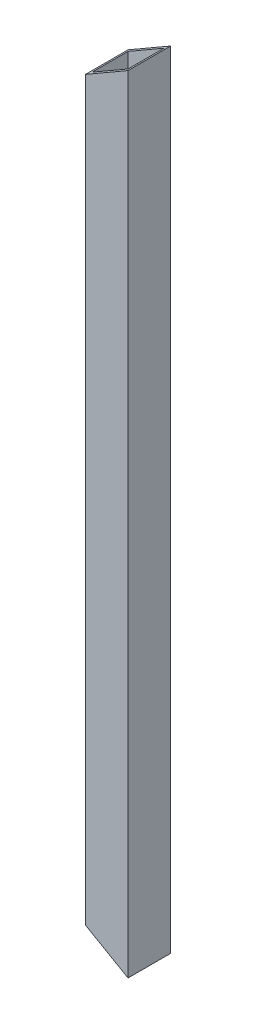
ISO-10303-21;
HEADER;
FILE_DESCRIPTION(('STEP AP214'),'2;1');
FILE_NAME('part.step','',(''),(''),'','','');
FILE_SCHEMA(('AUTOMOTIVE_DESIGN { 1 0 10303 214 1 1 1 1 }'));
ENDSEC;
DATA;
#1=APPLICATION_CONTEXT('core data for automotive mechanical design processes');
#2=APPLICATION_PROTOCOL_DEFINITION('international standard','automotive_design',2000,#1);
#3=PRODUCT_CONTEXT('',#1,'mechanical');
#4=PRODUCT('Part','Part','',(#3));
#5=PRODUCT_RELATED_PRODUCT_CATEGORY('part','',(#4));
#6=PRODUCT_DEFINITION_FORMATION('','',#4);
#7=PRODUCT_DEFINITION_CONTEXT('part definition',#1,'design');
#8=PRODUCT_DEFINITION('design','',#6,#7);
#9=PRODUCT_DEFINITION_SHAPE('','',#8);
#10=(LENGTH_UNIT() NAMED_UNIT(*) SI_UNIT(.MILLI.,.METRE.));
#11=(NAMED_UNIT(*) PLANE_ANGLE_UNIT() SI_UNIT($,.RADIAN.));
#12=(NAMED_UNIT(*) SI_UNIT($,.STERADIAN.) SOLID_ANGLE_UNIT());
#13=UNCERTAINTY_MEASURE_WITH_UNIT(LENGTH_MEASURE(1.E-05),#10,'distance_accuracy_value','');
#14=(GEOMETRIC_REPRESENTATION_CONTEXT(3) GLOBAL_UNCERTAINTY_ASSIGNED_CONTEXT((#13)) GLOBAL_UNIT_ASSIGNED_CONTEXT((#10,
#11,#12)) REPRESENTATION_CONTEXT('',''));
#15=CARTESIAN_POINT('',(0.,0.,0.));
#16=DIRECTION('',(0.,0.,1.));
#17=DIRECTION('',(1.,0.,0.));
#18=AXIS2_PLACEMENT_3D('',#15,#16,#17);
#19=CARTESIAN_POINT('',(-6.5,240.,6.5));
#20=DIRECTION('',(1.,0.,0.));
#21=DIRECTION('',(0.,0.,-1.));
#22=AXIS2_PLACEMENT_3D('',#19,#20,#21);
#23=PLANE('',#22);
#24=DIRECTION('',(0.,0.,1.));
#25=VECTOR('',#24,1.);
#26=CARTESIAN_POINT('',(-6.5,7.50555349946502,-233.5));
#27=LINE('',#26,#25);
#28=CARTESIAN_POINT('',(-6.5,7.50555349946502,-6.5));
#29=VERTEX_POINT('',#28);
#30=CARTESIAN_POINT('',(-6.5,7.50555349946502,6.5));
#31=VERTEX_POINT('',#30);
#32=EDGE_CURVE('E55',#29,#31,#27,.T.);
#33=ORIENTED_EDGE('',*,*,#32,.T.);
#34=DIRECTION('',(0.,-1.,0.));
#35=VECTOR('',#34,1.);
#36=CARTESIAN_POINT('',(-6.5,240.,6.5));
#37=LINE('',#36,#35);
#38=CARTESIAN_POINT('',(-6.5,232.494446500535,6.50000000000001));
#39=VERTEX_POINT('',#38);
#40=EDGE_CURVE('E116',#39,#31,#37,.T.);
#41=ORIENTED_EDGE('',*,*,#40,.F.);
#42=DIRECTION('',(0.,0.,-1.));
#43=VECTOR('',#42,1.);
#44=CARTESIAN_POINT('',(-6.5,232.494446500535,307.37892083029));
#45=LINE('',#44,#43);
#46=CARTESIAN_POINT('',(-6.5,232.494446500535,-6.50000000000001));
#47=VERTEX_POINT('',#46);
#48=EDGE_CURVE('E177',#39,#47,#45,.T.);
#49=ORIENTED_EDGE('',*,*,#48,.T.);
#50=DIRECTION('',(0.,-1.,0.));
#51=VECTOR('',#50,1.);
#52=CARTESIAN_POINT('',(-6.5,240.,-6.5));
#53=LINE('',#52,#51);
#54=EDGE_CURVE('E118',#47,#29,#53,.T.);
#55=ORIENTED_EDGE('',*,*,#54,.T.);
#56=EDGE_LOOP('',(#33,#41,#49,#55));
#57=FACE_BOUND('',#56,.T.);
#58=ADVANCED_FACE('F40',(#57),#23,.F.);
#59=CARTESIAN_POINT('',(-6.5,240.,6.5));
#60=DIRECTION('',(0.,0.,-1.));
#61=DIRECTION('',(-1.,0.,0.));
#62=AXIS2_PLACEMENT_3D('',#59,#60,#61);
#63=PLANE('',#62);
#64=DIRECTION('',(0.866025403784442,-0.499999999999994,0.));
#65=VECTOR('',#64,1.);
#66=CARTESIAN_POINT('',(6.5,0.,6.5));
#67=LINE('',#66,#65);
#68=CARTESIAN_POINT('',(6.5,0.,6.5));
#69=VERTEX_POINT('',#68);
#70=EDGE_CURVE('E102',#31,#69,#67,.T.);
#71=ORIENTED_EDGE('',*,*,#70,.T.);
#72=DIRECTION('',(0.,-1.,0.));
#73=VECTOR('',#72,1.);
#74=CARTESIAN_POINT('',(6.5,240.,6.5));
#75=LINE('',#74,#73);
#76=CARTESIAN_POINT('',(6.5,240.,6.50000000000001));
#77=VERTEX_POINT('',#76);
#78=EDGE_CURVE('E125',#77,#69,#75,.T.);
#79=ORIENTED_EDGE('',*,*,#78,.F.);
#80=DIRECTION('',(-0.866025403784442,-0.499999999999995,0.));
#81=VECTOR('',#80,1.);
#82=CARTESIAN_POINT('',(-3.25000000000007,234.370834875401,6.5));
#83=LINE('',#82,#81);
#84=EDGE_CURVE('E123',#77,#39,#83,.T.);
#85=ORIENTED_EDGE('',*,*,#84,.T.);
#86=ORIENTED_EDGE('',*,*,#40,.T.);
#87=EDGE_LOOP('',(#71,#79,#85,#86));
#88=FACE_BOUND('',#87,.T.);
#89=ADVANCED_FACE('F122',(#88),#63,.F.);
#90=CARTESIAN_POINT('',(-6.5,240.,-6.5));
#91=DIRECTION('',(0.,0.,1.));
#92=DIRECTION('',(1.,0.,0.));
#93=AXIS2_PLACEMENT_3D('',#90,#91,#92);
#94=PLANE('',#93);
#95=DIRECTION('',(0.866025403784442,-0.499999999999994,0.));
#96=VECTOR('',#95,1.);
#97=CARTESIAN_POINT('',(-107.173048454132,65.6291651245974,-6.49999999999999));
#98=LINE('',#97,#96);
#99=CARTESIAN_POINT('',(6.5,0.,-6.50000000000001));
#100=VERTEX_POINT('',#99);
#101=EDGE_CURVE('E180',#29,#100,#98,.T.);
#102=ORIENTED_EDGE('',*,*,#101,.F.);
#103=ORIENTED_EDGE('',*,*,#54,.F.);
#104=DIRECTION('',(0.866025403784442,0.499999999999994,0.));
#105=VECTOR('',#104,1.);
#106=CARTESIAN_POINT('',(-3.25000000000007,234.370834875401,-6.5));
#107=LINE('',#106,#105);
#108=CARTESIAN_POINT('',(6.5,240.,-6.5));
#109=VERTEX_POINT('',#108);
#110=EDGE_CURVE('E161',#47,#109,#107,.T.);
#111=ORIENTED_EDGE('',*,*,#110,.T.);
#112=DIRECTION('',(0.,-1.,0.));
#113=VECTOR('',#112,1.);
#114=CARTESIAN_POINT('',(6.5,240.,-6.5));
#115=LINE('',#114,#113);
#116=EDGE_CURVE('E130',#109,#100,#115,.T.);
#117=ORIENTED_EDGE('',*,*,#116,.T.);
#118=EDGE_LOOP('',(#102,#103,#111,#117));
#119=FACE_BOUND('',#118,.T.);
#120=ADVANCED_FACE('F218',(#119),#94,.F.);
#121=CARTESIAN_POINT('',(5.5,240.,5.5));
#122=DIRECTION('',(-1.,0.,0.));
#123=DIRECTION('',(0.,0.,1.));
#124=AXIS2_PLACEMENT_3D('',#121,#122,#123);
#125=PLANE('',#124);
#126=DIRECTION('',(0.,-1.,0.));
#127=VECTOR('',#126,1.);
#128=CARTESIAN_POINT('',(5.5,240.,-5.5));
#129=LINE('',#128,#127);
#130=CARTESIAN_POINT('',(5.5,239.42264973081,-5.5));
#131=VERTEX_POINT('',#130);
#132=CARTESIAN_POINT('',(5.50000000000001,0.577350269189578,-5.5));
#133=VERTEX_POINT('',#132);
#134=EDGE_CURVE('E141',#131,#133,#129,.T.);
#135=ORIENTED_EDGE('',*,*,#134,.T.);
#136=DIRECTION('',(0.,0.,1.));
#137=VECTOR('',#136,1.);
#138=CARTESIAN_POINT('',(5.5,0.577350269189619,5.5));
#139=LINE('',#138,#137);
#140=CARTESIAN_POINT('',(5.50000000000001,0.577350269189578,5.5));
#141=VERTEX_POINT('',#140);
#142=EDGE_CURVE('E183',#133,#141,#139,.T.);
#143=ORIENTED_EDGE('',*,*,#142,.T.);
#144=DIRECTION('',(0.,-1.,0.));
#145=VECTOR('',#144,1.);
#146=CARTESIAN_POINT('',(5.5,240.,5.5));
#147=LINE('',#146,#145);
#148=CARTESIAN_POINT('',(5.5,239.42264973081,5.5));
#149=VERTEX_POINT('',#148);
#150=EDGE_CURVE('E155',#149,#141,#147,.T.);
#151=ORIENTED_EDGE('',*,*,#150,.F.);
#152=DIRECTION('',(0.,0.,1.));
#153=VECTOR('',#152,1.);
#154=CARTESIAN_POINT('',(5.5,239.42264973081,5.5));
#155=LINE('',#154,#153);
#156=EDGE_CURVE('E165',#131,#149,#155,.T.);
#157=ORIENTED_EDGE('',*,*,#156,.F.);
#158=EDGE_LOOP('',(#135,#143,#151,#157));
#159=FACE_BOUND('',#158,.T.);
#160=ADVANCED_FACE('F206',(#159),#125,.T.);
#161=CARTESIAN_POINT('',(-5.5,240.,-5.5));
#162=DIRECTION('',(0.,0.,1.));
#163=DIRECTION('',(1.,0.,0.));
#164=AXIS2_PLACEMENT_3D('',#161,#162,#163);
#165=PLANE('',#164);
#166=DIRECTION('',(0.,-1.,0.));
#167=VECTOR('',#166,1.);
#168=CARTESIAN_POINT('',(-5.5,240.,-5.5));
#169=LINE('',#168,#167);
#170=CARTESIAN_POINT('',(-5.5,233.071796769725,-5.5));
#171=VERTEX_POINT('',#170);
#172=CARTESIAN_POINT('',(-5.5,6.9282032302754,-5.5));
#173=VERTEX_POINT('',#172);
#174=EDGE_CURVE('E147',#171,#173,#169,.T.);
#175=ORIENTED_EDGE('',*,*,#174,.T.);
#176=DIRECTION('',(0.866025403784442,-0.499999999999994,0.));
#177=VECTOR('',#176,1.);
#178=CARTESIAN_POINT('',(-106.423048454132,65.1961524227052,-5.5));
#179=LINE('',#178,#177);
#180=EDGE_CURVE('E187',#173,#133,#179,.T.);
#181=ORIENTED_EDGE('',*,*,#180,.T.);
#182=ORIENTED_EDGE('',*,*,#134,.F.);
#183=DIRECTION('',(0.866025403784442,0.499999999999995,0.));
#184=VECTOR('',#183,1.);
#185=CARTESIAN_POINT('',(-2.50000000000007,234.803847577293,-5.5));
#186=LINE('',#185,#184);
#187=EDGE_CURVE('E169',#171,#131,#186,.T.);
#188=ORIENTED_EDGE('',*,*,#187,.F.);
#189=EDGE_LOOP('',(#175,#181,#182,#188));
#190=FACE_BOUND('',#189,.T.);
#191=ADVANCED_FACE('F197',(#190),#165,.T.);
#192=CARTESIAN_POINT('',(-5.5,240.,5.5));
#193=DIRECTION('',(1.,0.,0.));
#194=DIRECTION('',(0.,0.,-1.));
#195=AXIS2_PLACEMENT_3D('',#192,#193,#194);
#196=PLANE('',#195);
#197=DIRECTION('',(0.,-1.,0.));
#198=VECTOR('',#197,1.);
#199=CARTESIAN_POINT('',(-5.5,240.,5.5));
#200=LINE('',#199,#198);
#201=CARTESIAN_POINT('',(-5.5,233.071796769725,5.5));
#202=VERTEX_POINT('',#201);
#203=CARTESIAN_POINT('',(-5.49999999999999,6.92820323027537,5.5));
#204=VERTEX_POINT('',#203);
#205=EDGE_CURVE('E151',#202,#204,#200,.T.);
#206=ORIENTED_EDGE('',*,*,#205,.T.);
#207=DIRECTION('',(0.,0.,-1.));
#208=VECTOR('',#207,1.);
#209=CARTESIAN_POINT('',(-5.5,6.9282032302754,5.5));
#210=LINE('',#209,#208);
#211=EDGE_CURVE('E63',#204,#173,#210,.T.);
#212=ORIENTED_EDGE('',*,*,#211,.T.);
#213=ORIENTED_EDGE('',*,*,#174,.F.);
#214=DIRECTION('',(0.,0.,-1.));
#215=VECTOR('',#214,1.);
#216=CARTESIAN_POINT('',(-5.5,233.071796769725,5.5));
#217=LINE('',#216,#215);
#218=EDGE_CURVE('E173',#202,#171,#217,.T.);
#219=ORIENTED_EDGE('',*,*,#218,.F.);
#220=EDGE_LOOP('',(#206,#212,#213,#219));
#221=FACE_BOUND('',#220,.T.);
#222=ADVANCED_FACE('F194',(#221),#196,.T.);
#223=CARTESIAN_POINT('',(-5.5,240.,5.5));
#224=DIRECTION('',(0.,0.,-1.));
#225=DIRECTION('',(-1.,0.,0.));
#226=AXIS2_PLACEMENT_3D('',#223,#224,#225);
#227=PLANE('',#226);
#228=ORIENTED_EDGE('',*,*,#150,.T.);
#229=DIRECTION('',(-0.866025403784442,0.499999999999994,0.));
#230=VECTOR('',#229,1.);
#231=CARTESIAN_POINT('',(-106.423048454132,65.1961524227052,5.5));
#232=LINE('',#231,#230);
#233=EDGE_CURVE('E12',#141,#204,#232,.T.);
#234=ORIENTED_EDGE('',*,*,#233,.T.);
#235=ORIENTED_EDGE('',*,*,#205,.F.);
#236=DIRECTION('',(-0.866025403784442,-0.499999999999995,0.));
#237=VECTOR('',#236,1.);
#238=CARTESIAN_POINT('',(-2.50000000000007,234.803847577293,5.5));
#239=LINE('',#238,#237);
#240=EDGE_CURVE('E48',#149,#202,#239,.T.);
#241=ORIENTED_EDGE('',*,*,#240,.F.);
#242=EDGE_LOOP('',(#228,#234,#235,#241));
#243=FACE_BOUND('',#242,.T.);
#244=ADVANCED_FACE('F204',(#243),#227,.T.);
#245=CARTESIAN_POINT('',(6.5,240.,6.5));
#246=DIRECTION('',(-1.,0.,0.));
#247=DIRECTION('',(0.,0.,1.));
#248=AXIS2_PLACEMENT_3D('',#245,#246,#247);
#249=PLANE('',#248);
#250=DIRECTION('',(0.,0.,-1.));
#251=VECTOR('',#250,1.);
#252=CARTESIAN_POINT('',(6.5,0.,6.5));
#253=LINE('',#252,#251);
#254=EDGE_CURVE('E105',#69,#100,#253,.T.);
#255=ORIENTED_EDGE('',*,*,#254,.T.);
#256=ORIENTED_EDGE('',*,*,#116,.F.);
#257=DIRECTION('',(0.,0.,-1.));
#258=VECTOR('',#257,1.);
#259=CARTESIAN_POINT('',(6.5,240.,6.5));
#260=LINE('',#259,#258);
#261=EDGE_CURVE('E138',#77,#109,#260,.T.);
#262=ORIENTED_EDGE('',*,*,#261,.F.);
#263=ORIENTED_EDGE('',*,*,#78,.T.);
#264=EDGE_LOOP('',(#255,#256,#262,#263));
#265=FACE_BOUND('',#264,.T.);
#266=ADVANCED_FACE('F212',(#265),#249,.F.);
#267=CARTESIAN_POINT('',(6.5,240.,307.37892083029));
#268=DIRECTION('',(0.499999999999994,-0.866025403784442,0.));
#269=DIRECTION('',(0.866025403784442,0.499999999999995,0.));
#270=AXIS2_PLACEMENT_3D('',#267,#268,#269);
#271=PLANE('',#270);
#272=ORIENTED_EDGE('',*,*,#187,.T.);
#273=ORIENTED_EDGE('',*,*,#156,.T.);
#274=ORIENTED_EDGE('',*,*,#240,.T.);
#275=ORIENTED_EDGE('',*,*,#218,.T.);
#276=EDGE_LOOP('',(#272,#273,#274,#275));
#277=FACE_BOUND('',#276,.T.);
#278=ORIENTED_EDGE('',*,*,#84,.F.);
#279=ORIENTED_EDGE('',*,*,#261,.T.);
#280=ORIENTED_EDGE('',*,*,#110,.F.);
#281=ORIENTED_EDGE('',*,*,#48,.F.);
#282=EDGE_LOOP('',(#278,#279,#280,#281));
#283=FACE_BOUND('',#282,.T.);
#284=ADVANCED_FACE('F200',(#277,#283),#271,.F.);
#285=CARTESIAN_POINT('',(6.5,0.,-233.5));
#286=DIRECTION('',(-0.499999999999994,-0.866025403784442,0.));
#287=DIRECTION('',(0.866025403784442,-0.499999999999994,0.));
#288=AXIS2_PLACEMENT_3D('',#285,#286,#287);
#289=PLANE('',#288);
#290=ORIENTED_EDGE('',*,*,#180,.F.);
#291=ORIENTED_EDGE('',*,*,#211,.F.);
#292=ORIENTED_EDGE('',*,*,#233,.F.);
#293=ORIENTED_EDGE('',*,*,#142,.F.);
#294=EDGE_LOOP('',(#290,#291,#292,#293));
#295=FACE_BOUND('',#294,.T.);
#296=ORIENTED_EDGE('',*,*,#101,.T.);
#297=ORIENTED_EDGE('',*,*,#254,.F.);
#298=ORIENTED_EDGE('',*,*,#70,.F.);
#299=ORIENTED_EDGE('',*,*,#32,.F.);
#300=EDGE_LOOP('',(#296,#297,#298,#299));
#301=FACE_BOUND('',#300,.T.);
#302=ADVANCED_FACE('F103',(#295,#301),#289,.T.);
#303=CLOSED_SHELL('',(#58,#89,#120,#160,#191,#222,#244,#266,#284,#302));
#304=MANIFOLD_SOLID_BREP('B2',#303);
#305=ADVANCED_BREP_SHAPE_REPRESENTATION('',(#18,#304),#14);
#306=SHAPE_DEFINITION_REPRESENTATION(#9,#305);
ENDSEC;
END-ISO-10303-21;
